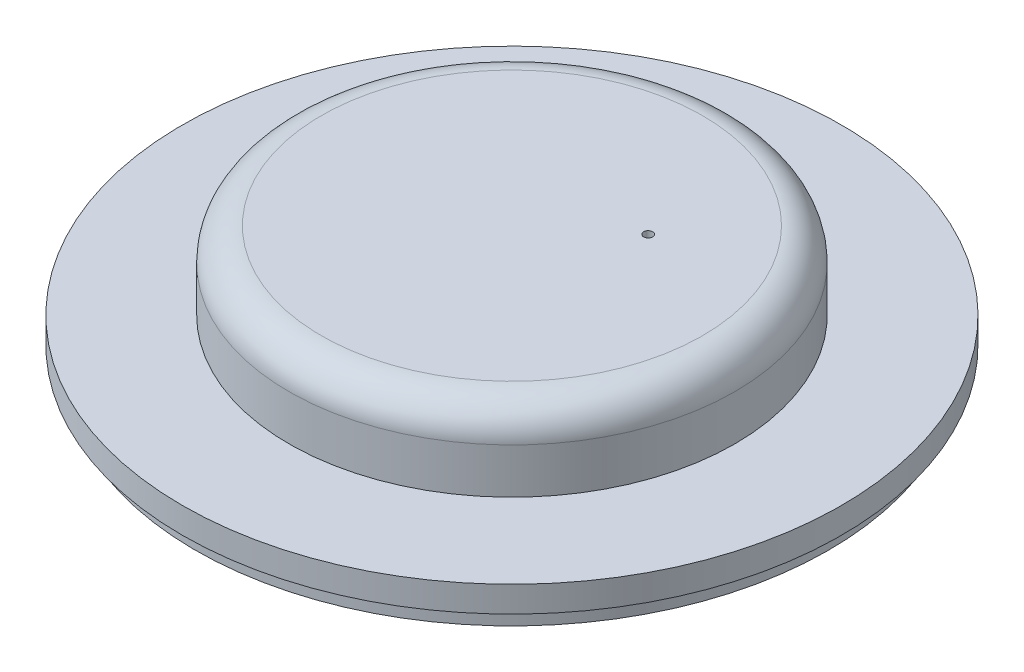
ISO-10303-21;
HEADER;
FILE_DESCRIPTION(('STEP AP214'),'2;1');
FILE_NAME('part.step','',(''),(''),'','','');
FILE_SCHEMA(('AUTOMOTIVE_DESIGN { 1 0 10303 214 1 1 1 1 }'));
ENDSEC;
DATA;
#1=APPLICATION_CONTEXT('core data for automotive mechanical design processes');
#2=APPLICATION_PROTOCOL_DEFINITION('international standard','automotive_design',2000,#1);
#3=PRODUCT_CONTEXT('',#1,'mechanical');
#4=PRODUCT('Part','Part','',(#3));
#5=PRODUCT_RELATED_PRODUCT_CATEGORY('part','',(#4));
#6=PRODUCT_DEFINITION_FORMATION('','',#4);
#7=PRODUCT_DEFINITION_CONTEXT('part definition',#1,'design');
#8=PRODUCT_DEFINITION('design','',#6,#7);
#9=PRODUCT_DEFINITION_SHAPE('','',#8);
#10=(LENGTH_UNIT() NAMED_UNIT(*) SI_UNIT(.MILLI.,.METRE.));
#11=(NAMED_UNIT(*) PLANE_ANGLE_UNIT() SI_UNIT($,.RADIAN.));
#12=(NAMED_UNIT(*) SI_UNIT($,.STERADIAN.) SOLID_ANGLE_UNIT());
#13=UNCERTAINTY_MEASURE_WITH_UNIT(LENGTH_MEASURE(1.E-05),#10,'distance_accuracy_value','');
#14=(GEOMETRIC_REPRESENTATION_CONTEXT(3) GLOBAL_UNCERTAINTY_ASSIGNED_CONTEXT((#13)) GLOBAL_UNIT_ASSIGNED_CONTEXT((#10,
#11,#12)) REPRESENTATION_CONTEXT('',''));
#15=CARTESIAN_POINT('',(0.,0.,0.));
#16=DIRECTION('',(0.,0.,1.));
#17=DIRECTION('',(1.,0.,0.));
#18=AXIS2_PLACEMENT_3D('',#15,#16,#17);
#19=CARTESIAN_POINT('',(-54.6596616755492,305.412651075744,-53.9904292114338));
#20=DIRECTION('',(0.,-1.,0.));
#21=DIRECTION('',(-0.625328031001878,0.,-0.780362001665455));
#22=AXIS2_PLACEMENT_3D('',#19,#20,#21);
#23=PLANE('',#22);
#24=CARTESIAN_POINT('',(-41.1984171468201,305.412651075744,-64.7773377462162));
#25=DIRECTION('',(0.,-1.,0.));
#26=DIRECTION('',(0.625328031001878,0.,0.780362001665454));
#27=AXIS2_PLACEMENT_3D('',#24,#25,#26);
#28=CIRCLE('',#27,25.5);
#29=CARTESIAN_POINT('',(-25.2525523562722,305.412651075744,-44.8781067037471));
#30=VERTEX_POINT('',#29);
#31=EDGE_CURVE('E11',#30,#30,#28,.T.);
#32=ORIENTED_EDGE('',*,*,#31,.T.);
#33=EDGE_LOOP('',(#32));
#34=FACE_BOUND('',#33,.T.);
#35=CARTESIAN_POINT('',(-41.1984171468201,305.412651075744,-64.7773377462162));
#36=DIRECTION('',(0.,-1.,0.));
#37=DIRECTION('',(-0.780362001665454,0.,0.625328031001878));
#38=AXIS2_PLACEMENT_3D('',#35,#36,#37);
#39=CIRCLE('',#38,24.5);
#40=CARTESIAN_POINT('',(-60.3172861876237,305.412651075744,-49.4568009866702));
#41=VERTEX_POINT('',#40);
#42=EDGE_CURVE('E76',#41,#41,#39,.T.);
#43=ORIENTED_EDGE('',*,*,#42,.F.);
#44=EDGE_LOOP('',(#43));
#45=FACE_BOUND('',#44,.T.);
#46=ADVANCED_FACE('F17',(#34,#45),#23,.T.);
#47=CARTESIAN_POINT('',(-52.7087566713856,313.412651075744,-55.5537492889385));
#48=DIRECTION('',(0.,1.,0.));
#49=DIRECTION('',(0.625328031001878,0.,0.780362001665455));
#50=AXIS2_PLACEMENT_3D('',#47,#48,#49);
#51=PLANE('',#50);
#52=CARTESIAN_POINT('',(-41.1984171468201,313.412651075744,-64.7773377462162));
#53=DIRECTION('',(0.,-1.,0.));
#54=DIRECTION('',(0.625328031001878,0.,0.780362001665454));
#55=AXIS2_PLACEMENT_3D('',#52,#53,#54);
#56=CIRCLE('',#55,14.75);
#57=CARTESIAN_POINT('',(-31.9748286895424,313.412651075744,-53.2669982216507));
#58=VERTEX_POINT('',#57);
#59=EDGE_CURVE('E99',#58,#58,#56,.T.);
#60=ORIENTED_EDGE('',*,*,#59,.F.);
#61=EDGE_LOOP('',(#60));
#62=FACE_BOUND('',#61,.T.);
#63=CARTESIAN_POINT('',(-35.3457021343292,313.412651075744,-69.4672979787303));
#64=DIRECTION('',(0.,-1.,0.));
#65=DIRECTION('',(-0.625328031001876,0.,-0.780362001665456));
#66=AXIS2_PLACEMENT_3D('',#63,#64,#65);
#67=CIRCLE('',#66,0.35);
#68=CARTESIAN_POINT('',(-35.5645669451798,313.412651075744,-69.7404246793132));
#69=VERTEX_POINT('',#68);
#70=EDGE_CURVE('E28',#69,#69,#67,.T.);
#71=ORIENTED_EDGE('',*,*,#70,.T.);
#72=EDGE_LOOP('',(#71));
#73=FACE_BOUND('',#72,.T.);
#74=ADVANCED_FACE('F129',(#62,#73),#51,.T.);
#75=CARTESIAN_POINT('',(-41.1984171468201,311.912651075744,-64.7773377462162));
#76=DIRECTION('',(0.,-1.,0.));
#77=DIRECTION('',(-0.625328031001878,0.,-0.780362001665455));
#78=AXIS2_PLACEMENT_3D('',#75,#76,#77);
#79=PLANE('',#78);
#80=CARTESIAN_POINT('',(-41.1984171468201,311.912651075744,-64.7773377462162));
#81=DIRECTION('',(0.,-1.,0.));
#82=DIRECTION('',(0.625328031001878,0.,0.780362001665454));
#83=AXIS2_PLACEMENT_3D('',#80,#81,#82);
#84=CIRCLE('',#83,14.75);
#85=CARTESIAN_POINT('',(-31.9748286895424,311.912651075744,-53.2669982216507));
#86=VERTEX_POINT('',#85);
#87=EDGE_CURVE('E115',#86,#86,#84,.T.);
#88=ORIENTED_EDGE('',*,*,#87,.T.);
#89=EDGE_LOOP('',(#88));
#90=FACE_BOUND('',#89,.T.);
#91=CARTESIAN_POINT('',(-35.3457021343292,311.912651075744,-69.4672979787303));
#92=DIRECTION('',(0.,1.,0.));
#93=DIRECTION('',(0.625328031001876,0.,0.780362001665456));
#94=AXIS2_PLACEMENT_3D('',#91,#92,#93);
#95=CIRCLE('',#94,0.35);
#96=CARTESIAN_POINT('',(-35.1268373234785,311.912651075744,-69.1941712781474));
#97=VERTEX_POINT('',#96);
#98=EDGE_CURVE('E111',#97,#97,#95,.T.);
#99=ORIENTED_EDGE('',*,*,#98,.T.);
#100=EDGE_LOOP('',(#99));
#101=FACE_BOUND('',#100,.T.);
#102=ADVANCED_FACE('F132',(#90,#101),#79,.T.);
#103=CARTESIAN_POINT('',(-61.0976481892892,307.412651075744,-48.8314729556683));
#104=DIRECTION('',(0.,1.,0.));
#105=DIRECTION('',(0.625328031001878,0.,0.780362001665455));
#106=AXIS2_PLACEMENT_3D('',#103,#104,#105);
#107=PLANE('',#106);
#108=CARTESIAN_POINT('',(-41.1984171468201,307.412651075744,-64.7773377462162));
#109=DIRECTION('',(0.,-1.,0.));
#110=DIRECTION('',(0.625328031001878,0.,0.780362001665454));
#111=AXIS2_PLACEMENT_3D('',#108,#109,#110);
#112=CIRCLE('',#111,17.25);
#113=CARTESIAN_POINT('',(-30.4115086120377,307.412651075744,-51.3160932174871));
#114=VERTEX_POINT('',#113);
#115=EDGE_CURVE('E104',#114,#114,#112,.T.);
#116=ORIENTED_EDGE('',*,*,#115,.T.);
#117=EDGE_LOOP('',(#116));
#118=FACE_BOUND('',#117,.T.);
#119=CARTESIAN_POINT('',(-41.1984171468201,307.412651075744,-64.7773377462162));
#120=DIRECTION('',(0.,-1.,0.));
#121=DIRECTION('',(0.625328031001878,0.,0.780362001665454));
#122=AXIS2_PLACEMENT_3D('',#119,#120,#121);
#123=CIRCLE('',#122,25.5);
#124=CARTESIAN_POINT('',(-25.2525523562722,307.412651075744,-44.8781067037471));
#125=VERTEX_POINT('',#124);
#126=EDGE_CURVE('E83',#125,#125,#123,.T.);
#127=ORIENTED_EDGE('',*,*,#126,.F.);
#128=EDGE_LOOP('',(#127));
#129=FACE_BOUND('',#128,.T.);
#130=ADVANCED_FACE('F143',(#118,#129),#107,.T.);
#131=CARTESIAN_POINT('',(-41.1984171468201,307.412651075744,-64.7773377462162));
#132=DIRECTION('',(0.,-1.,0.));
#133=DIRECTION('',(-0.625328031001878,0.,-0.780362001665455));
#134=AXIS2_PLACEMENT_3D('',#131,#132,#133);
#135=CYLINDRICAL_SURFACE('',#134,17.25);
#136=CARTESIAN_POINT('',(-41.1984171468201,310.912651075744,-64.7773377462162));
#137=DIRECTION('',(0.,-1.,0.));
#138=DIRECTION('',(0.625328031001878,0.,0.780362001665454));
#139=AXIS2_PLACEMENT_3D('',#136,#137,#138);
#140=CIRCLE('',#139,17.25);
#141=CARTESIAN_POINT('',(-30.4115086120377,310.912651075744,-51.3160932174871));
#142=VERTEX_POINT('',#141);
#143=EDGE_CURVE('E100',#142,#142,#140,.T.);
#144=ORIENTED_EDGE('',*,*,#143,.T.);
#145=EDGE_LOOP('',(#144));
#146=FACE_BOUND('',#145,.T.);
#147=ORIENTED_EDGE('',*,*,#115,.F.);
#148=EDGE_LOOP('',(#147));
#149=FACE_BOUND('',#148,.T.);
#150=ADVANCED_FACE('F150',(#146,#149),#135,.T.);
#151=CARTESIAN_POINT('',(-41.1984171468201,310.912651075744,-64.7773377462162));
#152=DIRECTION('',(0.,-1.,0.));
#153=DIRECTION('',(-0.625328031001878,0.,-0.780362001665455));
#154=AXIS2_PLACEMENT_3D('',#151,#152,#153);
#155=TOROIDAL_SURFACE('',#154,14.75,2.5);
#156=ORIENTED_EDGE('',*,*,#59,.T.);
#157=EDGE_LOOP('',(#156));
#158=FACE_BOUND('',#157,.T.);
#159=ORIENTED_EDGE('',*,*,#143,.F.);
#160=EDGE_LOOP('',(#159));
#161=FACE_BOUND('',#160,.T.);
#162=ADVANCED_FACE('F126',(#158,#161),#155,.T.);
#163=CARTESIAN_POINT('',(-41.1984171468201,310.912651075744,-64.7773377462162));
#164=DIRECTION('',(0.,-1.,0.));
#165=DIRECTION('',(-0.625328031001878,0.,-0.780362001665455));
#166=AXIS2_PLACEMENT_3D('',#163,#164,#165);
#167=TOROIDAL_SURFACE('',#166,14.75,1.);
#168=CARTESIAN_POINT('',(-41.1984171468201,310.912651075744,-64.7773377462162));
#169=DIRECTION('',(0.,-1.,0.));
#170=DIRECTION('',(0.625328031001878,0.,0.780362001665454));
#171=AXIS2_PLACEMENT_3D('',#168,#169,#170);
#172=CIRCLE('',#171,15.75);
#173=CARTESIAN_POINT('',(-31.3495006585405,310.912651075744,-52.4866362199853));
#174=VERTEX_POINT('',#173);
#175=EDGE_CURVE('E95',#174,#174,#172,.T.);
#176=ORIENTED_EDGE('',*,*,#175,.T.);
#177=EDGE_LOOP('',(#176));
#178=FACE_BOUND('',#177,.T.);
#179=ORIENTED_EDGE('',*,*,#87,.F.);
#180=EDGE_LOOP('',(#179));
#181=FACE_BOUND('',#180,.T.);
#182=ADVANCED_FACE('F177',(#178,#181),#167,.F.);
#183=CARTESIAN_POINT('',(-41.1984171468201,307.412651075744,-64.7773377462162));
#184=DIRECTION('',(0.,-1.,0.));
#185=DIRECTION('',(-0.625328031001878,0.,-0.780362001665455));
#186=AXIS2_PLACEMENT_3D('',#183,#184,#185);
#187=CYLINDRICAL_SURFACE('',#186,15.75);
#188=CARTESIAN_POINT('',(-41.1984171468201,305.412651075744,-64.7773377462162));
#189=DIRECTION('',(0.,-1.,0.));
#190=DIRECTION('',(0.625328031001878,0.,0.780362001665454));
#191=AXIS2_PLACEMENT_3D('',#188,#189,#190);
#192=CIRCLE('',#191,15.75);
#193=CARTESIAN_POINT('',(-31.3495006585405,305.412651075744,-52.4866362199853));
#194=VERTEX_POINT('',#193);
#195=EDGE_CURVE('E91',#194,#194,#192,.T.);
#196=ORIENTED_EDGE('',*,*,#195,.T.);
#197=EDGE_LOOP('',(#196));
#198=FACE_BOUND('',#197,.T.);
#199=ORIENTED_EDGE('',*,*,#175,.F.);
#200=EDGE_LOOP('',(#199));
#201=FACE_BOUND('',#200,.T.);
#202=ADVANCED_FACE('F173',(#198,#201),#187,.F.);
#203=CARTESIAN_POINT('',(-54.6596616755492,305.412651075744,-53.9904292114338));
#204=DIRECTION('',(0.,-1.,0.));
#205=DIRECTION('',(-0.625328031001878,0.,-0.780362001665455));
#206=AXIS2_PLACEMENT_3D('',#203,#204,#205);
#207=PLANE('',#206);
#208=CARTESIAN_POINT('',(-41.1984171468201,305.412651075744,-64.7773377462162));
#209=DIRECTION('',(0.,1.,0.));
#210=DIRECTION('',(0.625328031001878,0.,0.780362001665454));
#211=AXIS2_PLACEMENT_3D('',#208,#209,#210);
#212=CIRCLE('',#211,23.5);
#213=CARTESIAN_POINT('',(-26.503208418276,305.412651075744,-46.438830707078));
#214=VERTEX_POINT('',#213);
#215=EDGE_CURVE('E77',#214,#214,#212,.T.);
#216=ORIENTED_EDGE('',*,*,#215,.F.);
#217=EDGE_LOOP('',(#216));
#218=FACE_BOUND('',#217,.T.);
#219=ORIENTED_EDGE('',*,*,#195,.F.);
#220=EDGE_LOOP('',(#219));
#221=FACE_BOUND('',#220,.T.);
#222=ADVANCED_FACE('F169',(#218,#221),#207,.T.);
#223=CARTESIAN_POINT('',(-41.1984171468201,307.412651075744,-64.7773377462162));
#224=DIRECTION('',(0.,-1.,0.));
#225=DIRECTION('',(-0.625328031001878,0.,-0.780362001665455));
#226=AXIS2_PLACEMENT_3D('',#223,#224,#225);
#227=CYLINDRICAL_SURFACE('',#226,25.5);
#228=ORIENTED_EDGE('',*,*,#126,.T.);
#229=EDGE_LOOP('',(#228));
#230=FACE_BOUND('',#229,.T.);
#231=ORIENTED_EDGE('',*,*,#31,.F.);
#232=EDGE_LOOP('',(#231));
#233=FACE_BOUND('',#232,.T.);
#234=ADVANCED_FACE('F139',(#230,#233),#227,.T.);
#235=CARTESIAN_POINT('',(-35.3457021343292,361.912651075744,-69.4672979787303));
#236=DIRECTION('',(0.,-1.,0.));
#237=DIRECTION('',(-0.625328031001876,0.,-0.780362001665456));
#238=AXIS2_PLACEMENT_3D('',#235,#236,#237);
#239=CYLINDRICAL_SURFACE('',#238,0.35);
#240=ORIENTED_EDGE('',*,*,#70,.F.);
#241=EDGE_LOOP('',(#240));
#242=FACE_BOUND('',#241,.T.);
#243=ORIENTED_EDGE('',*,*,#98,.F.);
#244=EDGE_LOOP('',(#243));
#245=FACE_BOUND('',#244,.T.);
#246=ADVANCED_FACE('F135',(#242,#245),#239,.F.);
#247=CARTESIAN_POINT('',(-41.1984171468201,303.912651075744,-64.7773377462162));
#248=DIRECTION('',(0.,1.,0.));
#249=DIRECTION('',(0.625328031001878,0.,0.780362001665455));
#250=AXIS2_PLACEMENT_3D('',#247,#248,#249);
#251=CYLINDRICAL_SURFACE('',#250,24.5);
#252=CARTESIAN_POINT('',(-41.1984171468201,303.912651075744,-64.7773377462162));
#253=DIRECTION('',(0.,-1.,0.));
#254=DIRECTION('',(-0.780362001665454,0.,0.625328031001878));
#255=AXIS2_PLACEMENT_3D('',#252,#253,#254);
#256=CIRCLE('',#255,24.5);
#257=CARTESIAN_POINT('',(-60.3172861876237,303.912651075744,-49.4568009866702));
#258=VERTEX_POINT('',#257);
#259=EDGE_CURVE('E70',#258,#258,#256,.T.);
#260=ORIENTED_EDGE('',*,*,#259,.F.);
#261=EDGE_LOOP('',(#260));
#262=FACE_BOUND('',#261,.T.);
#263=ORIENTED_EDGE('',*,*,#42,.T.);
#264=EDGE_LOOP('',(#263));
#265=FACE_BOUND('',#264,.T.);
#266=ADVANCED_FACE('F138',(#262,#265),#251,.T.);
#267=CARTESIAN_POINT('',(-41.1984171468201,303.912651075744,-64.7773377462162));
#268=DIRECTION('',(0.,1.,0.));
#269=DIRECTION('',(0.625328031001878,0.,0.780362001665455));
#270=AXIS2_PLACEMENT_3D('',#267,#268,#269);
#271=CYLINDRICAL_SURFACE('',#270,23.5);
#272=CARTESIAN_POINT('',(-41.1984171468201,303.912651075744,-64.7773377462162));
#273=DIRECTION('',(0.,-1.,0.));
#274=DIRECTION('',(-0.780362001665454,0.,0.625328031001878));
#275=AXIS2_PLACEMENT_3D('',#272,#273,#274);
#276=CIRCLE('',#275,23.5);
#277=CARTESIAN_POINT('',(-59.5369241859583,303.912651075744,-50.0821290176721));
#278=VERTEX_POINT('',#277);
#279=EDGE_CURVE('E21',#278,#278,#276,.T.);
#280=ORIENTED_EDGE('',*,*,#279,.T.);
#281=EDGE_LOOP('',(#280));
#282=FACE_BOUND('',#281,.T.);
#283=ORIENTED_EDGE('',*,*,#215,.T.);
#284=EDGE_LOOP('',(#283));
#285=FACE_BOUND('',#284,.T.);
#286=ADVANCED_FACE('F161',(#282,#285),#271,.F.);
#287=CARTESIAN_POINT('',(-41.1984171468201,303.912651075744,-64.7773377462162));
#288=DIRECTION('',(0.,-1.,0.));
#289=DIRECTION('',(-0.625328031001878,0.,-0.780362001665455));
#290=AXIS2_PLACEMENT_3D('',#287,#288,#289);
#291=PLANE('',#290);
#292=ORIENTED_EDGE('',*,*,#259,.T.);
#293=EDGE_LOOP('',(#292));
#294=FACE_BOUND('',#293,.T.);
#295=ORIENTED_EDGE('',*,*,#279,.F.);
#296=EDGE_LOOP('',(#295));
#297=FACE_BOUND('',#296,.T.);
#298=ADVANCED_FACE('F19',(#294,#297),#291,.T.);
#299=CLOSED_SHELL('',(#46,#74,#102,#130,#150,#162,#182,#202,#222,#234,#246,#266,#286,#298));
#300=MANIFOLD_SOLID_BREP('B1',#299);
#301=ADVANCED_BREP_SHAPE_REPRESENTATION('',(#18,#300),#14);
#302=SHAPE_DEFINITION_REPRESENTATION(#9,#301);
ENDSEC;
END-ISO-10303-21;
